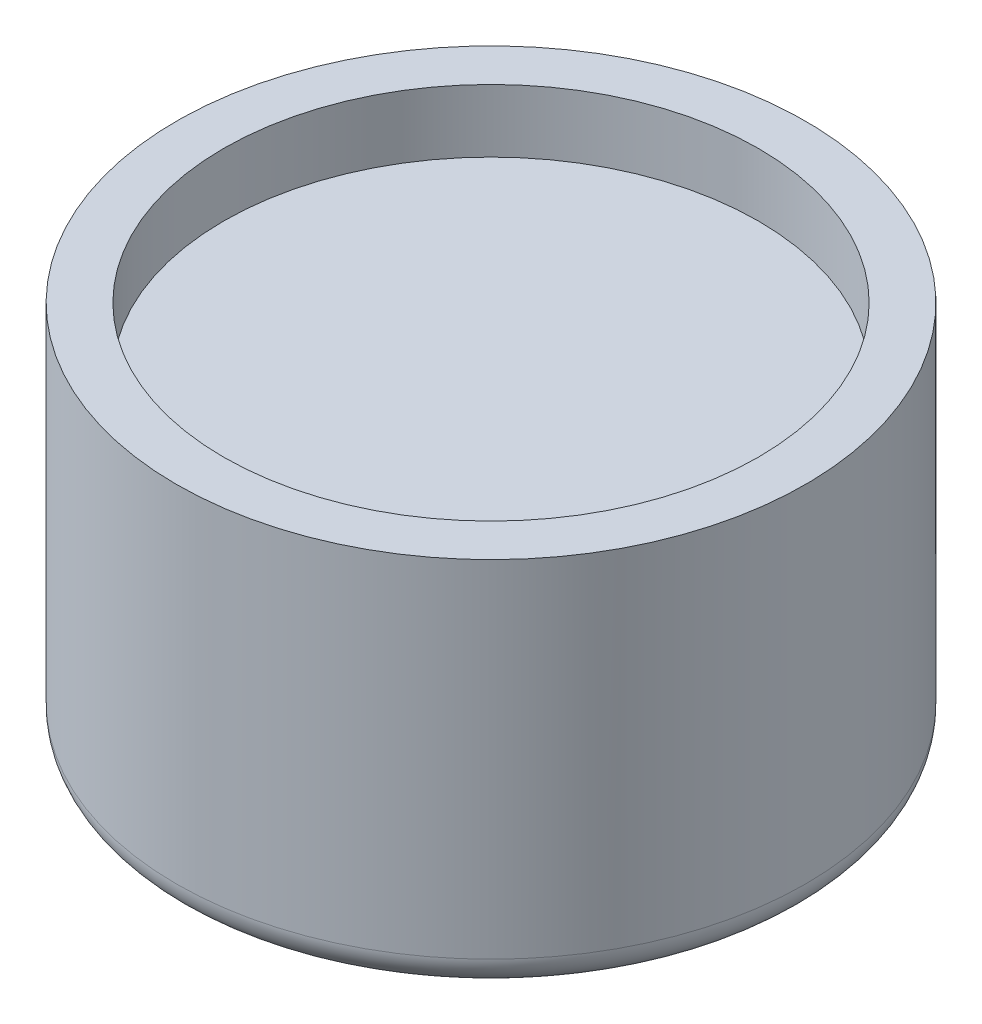
ISO-10303-21;
HEADER;
FILE_DESCRIPTION(('STEP AP214'),'2;1');
FILE_NAME('part.step','',(''),(''),'','','');
FILE_SCHEMA(('AUTOMOTIVE_DESIGN { 1 0 10303 214 1 1 1 1 }'));
ENDSEC;
DATA;
#1=APPLICATION_CONTEXT('core data for automotive mechanical design processes');
#2=APPLICATION_PROTOCOL_DEFINITION('international standard','automotive_design',2000,#1);
#3=PRODUCT_CONTEXT('',#1,'mechanical');
#4=PRODUCT('Part','Part','',(#3));
#5=PRODUCT_RELATED_PRODUCT_CATEGORY('part','',(#4));
#6=PRODUCT_DEFINITION_FORMATION('','',#4);
#7=PRODUCT_DEFINITION_CONTEXT('part definition',#1,'design');
#8=PRODUCT_DEFINITION('design','',#6,#7);
#9=PRODUCT_DEFINITION_SHAPE('','',#8);
#10=(LENGTH_UNIT() NAMED_UNIT(*) SI_UNIT(.MILLI.,.METRE.));
#11=(NAMED_UNIT(*) PLANE_ANGLE_UNIT() SI_UNIT($,.RADIAN.));
#12=(NAMED_UNIT(*) SI_UNIT($,.STERADIAN.) SOLID_ANGLE_UNIT());
#13=UNCERTAINTY_MEASURE_WITH_UNIT(LENGTH_MEASURE(1.E-05),#10,'distance_accuracy_value','');
#14=(GEOMETRIC_REPRESENTATION_CONTEXT(3) GLOBAL_UNCERTAINTY_ASSIGNED_CONTEXT((#13)) GLOBAL_UNIT_ASSIGNED_CONTEXT((#10,
#11,#12)) REPRESENTATION_CONTEXT('',''));
#15=CARTESIAN_POINT('',(0.,0.,0.));
#16=DIRECTION('',(0.,0.,1.));
#17=DIRECTION('',(1.,0.,0.));
#18=AXIS2_PLACEMENT_3D('',#15,#16,#17);
#19=CARTESIAN_POINT('',(0.,5.,0.));
#20=DIRECTION('',(0.,1.,0.));
#21=DIRECTION('',(0.,0.,1.));
#22=AXIS2_PLACEMENT_3D('',#19,#20,#21);
#23=PLANE('',#22);
#24=CARTESIAN_POINT('',(0.,5.,0.));
#25=DIRECTION('',(0.,1.,0.));
#26=DIRECTION('',(0.,0.,1.));
#27=AXIS2_PLACEMENT_3D('',#24,#25,#26);
#28=CIRCLE('',#27,4.25);
#29=CARTESIAN_POINT('',(0.,5.,4.25));
#30=VERTEX_POINT('',#29);
#31=EDGE_CURVE('E41',#30,#30,#28,.T.);
#32=ORIENTED_EDGE('',*,*,#31,.T.);
#33=EDGE_LOOP('',(#32));
#34=FACE_BOUND('',#33,.T.);
#35=ADVANCED_FACE('F16',(#34),#23,.T.);
#36=CARTESIAN_POINT('',(0.,6.,0.));
#37=DIRECTION('',(0.,1.,0.));
#38=DIRECTION('',(0.,0.,1.));
#39=AXIS2_PLACEMENT_3D('',#36,#37,#38);
#40=CYLINDRICAL_SURFACE('',#39,4.25);
#41=ORIENTED_EDGE('',*,*,#31,.F.);
#42=EDGE_LOOP('',(#41));
#43=FACE_BOUND('',#42,.T.);
#44=CARTESIAN_POINT('',(0.,6.,0.));
#45=DIRECTION('',(0.,1.,0.));
#46=DIRECTION('',(0.,0.,1.));
#47=AXIS2_PLACEMENT_3D('',#44,#45,#46);
#48=CIRCLE('',#47,4.25);
#49=CARTESIAN_POINT('',(0.,6.,4.25));
#50=VERTEX_POINT('',#49);
#51=EDGE_CURVE('E40',#50,#50,#48,.F.);
#52=ORIENTED_EDGE('',*,*,#51,.F.);
#53=EDGE_LOOP('',(#52));
#54=FACE_BOUND('',#53,.T.);
#55=ADVANCED_FACE('F73',(#43,#54),#40,.F.);
#56=CARTESIAN_POINT('',(0.,0.,0.));
#57=DIRECTION('',(0.,1.,0.));
#58=DIRECTION('',(0.,0.,1.));
#59=AXIS2_PLACEMENT_3D('',#56,#57,#58);
#60=PLANE('',#59);
#61=CARTESIAN_POINT('',(4.5,0.,0.));
#62=CARTESIAN_POINT('',(4.49999865411168,2.59689359989175E-12,-0.00499675006296749));
#63=CARTESIAN_POINT('',(4.49998954647222,4.87203615316466E-12,-0.00999345011623569));
#64=CARTESIAN_POINT('',(4.49995501930905,8.9327089056936E-12,-0.0200599822973414));
#65=CARTESIAN_POINT('',(4.49992936281391,1.07105794766739E-11,-0.0251298136019733));
#66=CARTESIAN_POINT('',(4.49943785046082,3.33516191594242E-11,-0.0979821605595964));
#67=CARTESIAN_POINT('',(4.49745256561761,1.82608353634555E-11,-0.165763677129862));
#68=CARTESIAN_POINT('',(4.490494512553,7.5309834208971E-12,-0.299725462395249));
#69=CARTESIAN_POINT('',(4.48558604828889,1.14858494829331E-11,-0.365909181856865));
#70=CARTESIAN_POINT('',(4.47298602629871,1.4093982737586E-11,-0.496563836197475));
#71=CARTESIAN_POINT('',(4.46535712980481,1.28603582760707E-11,-0.561040789973089));
#72=CARTESIAN_POINT('',(4.44751711752088,1.15263729310724E-11,-0.688178569808935));
#73=CARTESIAN_POINT('',(4.43736698888563,1.14014977418934E-11,-0.750847972107178));
#74=CARTESIAN_POINT('',(4.41395756768151,1.06370054190931E-11,-0.87824403248873));
#75=CARTESIAN_POINT('',(4.40058850786163,9.97663677320819E-12,-0.942950559134198));
#76=CARTESIAN_POINT('',(4.37138066635393,8.62503302038813E-12,-1.07011915694753));
#77=CARTESIAN_POINT('',(4.35561115898539,7.93496554984998E-12,-1.13259715403875));
#78=CARTESIAN_POINT('',(4.3218381136348,6.47119975005065E-12,-1.25524291034144));
#79=CARTESIAN_POINT('',(4.30390138685278,5.7000666631746E-12,-1.31542907167455));
#80=CARTESIAN_POINT('',(4.26602455695965,4.19405168575086E-12,-1.43344195397927));
#81=CARTESIAN_POINT('',(4.24614874063509,3.45874864721853E-12,-1.49128931516648));
#82=CARTESIAN_POINT('',(4.20461838350872,2.12303061026002E-12,-1.60459142234941));
#83=CARTESIAN_POINT('',(4.18302556303364,1.51953630170094E-12,-1.66006879784721));
#84=CARTESIAN_POINT('',(4.13827909763198,5.74205175569652E-13,-1.76861237421003));
#85=CARTESIAN_POINT('',(4.11518458048482,2.25639520609268E-13,-1.82170295649495));
#86=CARTESIAN_POINT('',(4.06764522901688,0.,-1.92546782045812));
#87=CARTESIAN_POINT('',(4.04325691899074,0.,-1.97616800465758));
#88=CARTESIAN_POINT('',(3.99333258263638,6.34351207089993E-13,-2.07515915717594));
#89=CARTESIAN_POINT('',(3.96785047983463,1.22918354127953E-12,-2.12347732699227));
#90=CARTESIAN_POINT('',(3.91593284418015,3.16581678824798E-12,-2.2177225689304));
#91=CARTESIAN_POINT('',(3.88954864934465,4.48473601440582E-12,-2.26367792803129));
#92=CARTESIAN_POINT('',(3.83601251462436,8.06861766353863E-12,-2.3532255324317));
#93=CARTESIAN_POINT('',(3.8089093532334,1.03031466455144E-11,-2.3968469463674));
#94=CARTESIAN_POINT('',(3.7541121119354,1.59362677338299E-11,-2.48176344850524));
#95=CARTESIAN_POINT('',(3.72646428848266,1.92955505796562E-11,-2.52308839100532));
#96=CARTESIAN_POINT('',(3.67074575006553,2.74158323091525E-11,-2.6034562827731));
#97=CARTESIAN_POINT('',(3.6427188099954,3.21271253225399E-11,-2.64252959163748));
#98=CARTESIAN_POINT('',(3.58640058249699,4.32053576779507E-11,-2.71844573299863));
#99=CARTESIAN_POINT('',(3.55815065761543,4.95105810152731E-11,-2.75531923773919));
#100=CARTESIAN_POINT('',(3.50153781425057,6.40607654844297E-11,-2.82689113145519));
#101=CARTESIAN_POINT('',(3.47321384426522,7.22296713374785E-11,-2.86162040309026));
#102=CARTESIAN_POINT('',(3.38985973887229,9.95277158890048E-11,-2.96076271343289));
#103=CARTESIAN_POINT('',(3.3335061701867,1.21939415561274E-10,-3.02407218811909));
#104=CARTESIAN_POINT('',(3.22180200666614,1.78626097712111E-10,-3.14264643117861));
#105=CARTESIAN_POINT('',(3.16670941724362,2.11852507423687E-10,-3.19815503152203));
#106=CARTESIAN_POINT('',(3.0584310495235,2.93322876760002E-10,-3.30170966693315));
#107=CARTESIAN_POINT('',(3.00547089179811,3.40079179106949E-10,-3.34999162754029));
#108=CARTESIAN_POINT('',(2.90224098845796,4.52010226715788E-10,-3.43968431911652));
#109=CARTESIAN_POINT('',(2.85216657757696,5.15115515559693E-10,-3.48132006629898));
#110=CARTESIAN_POINT('',(2.75537486348196,6.64096521296629E-10,-3.55831031051543));
#111=CARTESIAN_POINT('',(2.70882521781141,7.47050224096827E-10,-3.59387576463521));
#112=CARTESIAN_POINT('',(2.61964384553695,9.39078846639522E-10,-3.65929633348751));
#113=CARTESIAN_POINT('',(2.57715464359881,1.04420542408859E-09,-3.68934576688818));
#114=CARTESIAN_POINT('',(2.49656375555173,1.28947371942859E-09,-3.74427071246415));
#115=CARTESIAN_POINT('',(2.4585814422383,1.4235575400647E-09,-3.76932196718613));
#116=CARTESIAN_POINT('',(2.36005085614684,1.8359674869961E-09,-3.83218480886824));
#117=CARTESIAN_POINT('',(2.29895654801143,2.15295766165364E-09,-3.86914884219264));
#118=CARTESIAN_POINT('',(2.21967659550874,2.85451656375528E-09,-3.91457749645505));
#119=CARTESIAN_POINT('',(2.20225970589944,3.02619751430857E-09,-3.92440409178397));
#120=CARTESIAN_POINT('',(2.13924235196901,3.79410537307291E-09,-3.95940797631627));
#121=CARTESIAN_POINT('',(2.09326547778119,4.6295111582452E-09,-3.9839143138786));
#122=CARTESIAN_POINT('',(2.00049368312736,7.72900346212359E-09,-4.0313190485536));
#123=CARTESIAN_POINT('',(1.95369876036296,9.99309399549682E-09,-4.05421744114767));
#124=CARTESIAN_POINT('',(1.83110573556198,1.82325637024631E-08,-4.11159609440829));
#125=CARTESIAN_POINT('',(1.75470875480601,2.56180532676822E-08,-4.14480732556845));
#126=CARTESIAN_POINT('',(1.60019681162996,5.63609027570836E-08,-4.20695280703466));
#127=CARTESIAN_POINT('',(1.52208181856918,7.97185477682107E-08,-4.23588698098832));
#128=CARTESIAN_POINT('',(1.36158927598217,1.3517866802838E-07,-4.2903227767341));
#129=CARTESIAN_POINT('',(1.27915851590899,1.67560271350191E-07,-4.31566752860503));
#130=CARTESIAN_POINT('',(1.11297997369441,3.2229547544817E-07,-4.36162991289569));
#131=CARTESIAN_POINT('',(1.02923214452573,4.44652296050821E-07,-4.38224737611143));
#132=CARTESIAN_POINT('',(0.893210518311134,5.22967091260424E-07,-4.4115198127157));
#133=CARTESIAN_POINT('',(0.84126377211779,5.2491986657839E-07,-4.42172063360344));
#134=CARTESIAN_POINT('',(0.709349609812779,4.57737121334612E-07,-4.44516222716193));
#135=CARTESIAN_POINT('',(0.629152038692941,3.50298085661709E-07,-4.45714044541284));
#136=CARTESIAN_POINT('',(0.510919176837907,2.21070283018866E-07,-4.47153955966513));
#137=CARTESIAN_POINT('',(0.473080995279817,1.84076799194586E-07,-4.47566000959577));
#138=CARTESIAN_POINT('',(0.393292162141107,1.12163475969662E-07,-4.48331694925242));
#139=CARTESIAN_POINT('',(0.351330942319515,7.78796184002097E-08,-4.48674516587457));
#140=CARTESIAN_POINT('',(0.260918029761658,2.79479882455748E-08,-4.49286937058273));
#141=CARTESIAN_POINT('',(0.212453383455709,1.59440622452671E-08,-4.49537368951699));
#142=CARTESIAN_POINT('',(0.113572976139317,4.08862389302433E-09,-4.4989196897745));
#143=CARTESIAN_POINT('',(0.0631550150269918,4.73058879759908E-09,-4.49990035762631));
#144=CARTESIAN_POINT('',(-0.0447670899670695,2.94294463269521E-09,-4.50020866078059));
#145=CARTESIAN_POINT('',(-0.102271935772468,6.92706013065561E-11,-4.49928478348046));
#146=CARTESIAN_POINT('',(-0.219496883996692,3.42489690237561E-08,-4.49522330394998));
#147=CARTESIAN_POINT('',(-0.279214155120876,7.28944335360841E-08,-4.49199914187946));
#148=CARTESIAN_POINT('',(-0.346155855091588,9.98769209125065E-08,-4.4869896655943));
#149=CARTESIAN_POINT('',(-0.353476615030143,1.02607886031263E-07,-4.48642305349178));
#150=CARTESIAN_POINT('',(-0.388123657285773,1.1243687937026E-07,-4.48365139371331));
#151=CARTESIAN_POINT('',(-0.415430778810368,1.11064661437501E-07,-4.48120166667584));
#152=CARTESIAN_POINT('',(-0.488979909004488,1.08351333480203E-07,-4.47392701502406));
#153=CARTESIAN_POINT('',(-0.535175923104512,1.07696259921799E-07,-4.46863545923035));
#154=CARTESIAN_POINT('',(-0.646299961987057,1.02937448571343E-07,-4.45415342260339));
#155=CARTESIAN_POINT('',(-0.711137354607036,9.75290852324083E-08,-4.44425401302293));
#156=CARTESIAN_POINT('',(-0.815064321632313,8.90530821068662E-08,-4.42605380042151));
#157=CARTESIAN_POINT('',(-0.854312207985323,8.58968041216587E-08,-4.41864055642944));
#158=CARTESIAN_POINT('',(-0.937271538306661,7.90212902806841E-08,-4.40182362269227));
#159=CARTESIAN_POINT('',(-0.980956384771906,7.52798348455399E-08,-4.39228795895876));
#160=CARTESIAN_POINT('',(-1.07266578913683,6.74819955062817E-08,-4.37083233125505));
#161=CARTESIAN_POINT('',(-1.12065623479983,6.34345865761933E-08,-4.35876653811374));
#162=CARTESIAN_POINT('',(-1.22081837636423,5.51473111858201E-08,-4.33181949023177));
#163=CARTESIAN_POINT('',(-1.27294728494928,5.09264910763505E-08,-4.31677896287793));
#164=CARTESIAN_POINT('',(-1.38118407864704,4.2492976644423E-08,-4.28341813570604));
#165=CARTESIAN_POINT('',(-1.4372389408625,3.83136091774277E-08,-4.26492575248122));
#166=CARTESIAN_POINT('',(-1.55307747625644,3.01766155843957E-08,-4.22416680911618));
#167=CARTESIAN_POINT('',(-1.61279650562832,2.62641866466582E-08,-4.20171603005985));
#168=CARTESIAN_POINT('',(-1.71526845681852,2.01279369466837E-08,-4.16068565375369));
#169=CARTESIAN_POINT('',(-1.75825752831525,1.77331640912321E-08,-4.14269273435366));
#170=CARTESIAN_POINT('',(-1.84572036432615,1.32601894832249E-08,-4.10447829287175));
#171=CARTESIAN_POINT('',(-1.89016548571414,1.12028782059638E-08,-4.08419109284364));
#172=CARTESIAN_POINT('',(-1.98040422494043,7.50107029250143E-09,-4.04121207540746));
#173=CARTESIAN_POINT('',(-2.02616556632368,5.87997376428474E-09,-4.01845252223938));
#174=CARTESIAN_POINT('',(-2.11888632640923,3.14578599535284E-09,-3.97035015965651));
#175=CARTESIAN_POINT('',(-2.16580968937655,2.05822614735925E-09,-3.94493771323524));
#176=CARTESIAN_POINT('',(-2.23826793661094,8.8344503592233E-10,-3.90401348192259));
#177=CARTESIAN_POINT('',(-2.26412452022149,5.66615865899054E-10,-3.88906830342179));
#178=CARTESIAN_POINT('',(-2.31543985038303,1.37901598385976E-10,-3.85872272737265));
#179=CARTESIAN_POINT('',(-2.34089971722689,2.52603127115696E-11,-3.84332422497109));
#180=CARTESIAN_POINT('',(-2.40645863207055,-3.01989914719666E-11,-3.80277998809949));
#181=CARTESIAN_POINT('',(-2.44632078683041,1.66613590977135E-10,-3.77724985667688));
#182=CARTESIAN_POINT('',(-2.52498351307025,9.53902732878185E-10,-3.72510187643389));
#183=CARTESIAN_POINT('',(-2.56378900864303,1.54201725550955E-09,-3.69849144825557));
#184=CARTESIAN_POINT('',(-2.64031583590176,3.04025531138856E-09,-3.64423077766955));
#185=CARTESIAN_POINT('',(-2.67804228660985,3.9484197397186E-09,-3.61658775641122));
#186=CARTESIAN_POINT('',(-2.75238966817957,6.01997130422112E-09,-3.56031041244632));
#187=CARTESIAN_POINT('',(-2.78901590909801,7.18178005814181E-09,-3.53168310411577));
#188=CARTESIAN_POINT('',(-2.86114381242737,9.69798264247872E-09,-3.47348555605035));
#189=CARTESIAN_POINT('',(-2.89665096540876,1.10511604536398E-08,-3.44392212104288));
#190=CARTESIAN_POINT('',(-2.9665235901693,1.38918049680843E-08,-3.3839006602086));
#191=CARTESIAN_POINT('',(-3.00089472434781,1.53783980289682E-08,-3.35344922582049));
#192=CARTESIAN_POINT('',(-3.06848024027602,1.8431864227492E-08,-3.29169990541098));
#193=CARTESIAN_POINT('',(-3.10170044689178,1.99981859588746E-08,-3.2604083948696));
#194=CARTESIAN_POINT('',(-3.16697086628912,2.31614155034655E-08,-3.19702698690483));
#195=CARTESIAN_POINT('',(-3.19902705806199,2.47580733406543E-08,-3.16494324547877));
#196=CARTESIAN_POINT('',(-3.26195851119518,2.79365437991445E-08,-3.10002460708549));
#197=CARTESIAN_POINT('',(-3.29283989415986,2.95183868794281E-08,-3.06719564775748));
#198=CARTESIAN_POINT('',(-3.35341115214892,3.26262414151268E-08,-3.00083544859059));
#199=CARTESIAN_POINT('',(-3.38310729181109,3.41525411024271E-08,-2.96730991362886));
#200=CARTESIAN_POINT('',(-3.4701205773099,3.8577486919585E-08,-2.8660707498353));
#201=CARTESIAN_POINT('',(-3.52596084299639,4.13538352334384E-08,-2.79707678464828));
#202=CARTESIAN_POINT('',(-3.63277716599046,4.62855339343512E-08,-2.65681500027606));
#203=CARTESIAN_POINT('',(-3.68380618229313,4.84483535731855E-08,-2.58558740951594));
#204=CARTESIAN_POINT('',(-3.78099112992385,5.19782019791519E-08,-2.44121431615625));
#205=CARTESIAN_POINT('',(-3.82720149897263,5.33551504069439E-08,-2.36810547804084));
#206=CARTESIAN_POINT('',(-3.91475860300241,5.52070219635696E-08,-2.22032212644009));
#207=CARTESIAN_POINT('',(-3.9561610725322,5.56935137362828E-08,-2.14568062293429));
#208=CARTESIAN_POINT('',(-4.03413681421899,5.57277567157342E-08,-1.99517002264114));
#209=CARTESIAN_POINT('',(-4.07076683799535,5.52878691306394E-08,-1.91933032447582));
#210=CARTESIAN_POINT('',(-4.13925315750032,5.35019563454424E-08,-1.76674848524941));
#211=CARTESIAN_POINT('',(-4.17116698033033,5.21681854134207E-08,-1.69003216042974));
#212=CARTESIAN_POINT('',(-4.23029622028395,4.86965555901375E-08,-1.53600767108068));
#213=CARTESIAN_POINT('',(-4.2575697013798,4.65698940065424E-08,-1.45872179291051));
#214=CARTESIAN_POINT('',(-4.30751152028329,4.16839494576026E-08,-1.30385360230514));
#215=CARTESIAN_POINT('',(-4.33023823362103,3.89338049913649E-08,-1.22629011066383));
#216=CARTESIAN_POINT('',(-4.37119603971805,3.3042073032231E-08,-1.07114620679539));
#217=CARTESIAN_POINT('',(-4.38948560520694,2.99065033714248E-08,-0.993581227366811));
#218=CARTESIAN_POINT('',(-4.42169310947533,2.35540066275115E-08,-0.838697480894016));
#219=CARTESIAN_POINT('',(-4.43566941710033,2.03388661761525E-08,-0.761390847504664));
#220=CARTESIAN_POINT('',(-4.45938745429776,1.42094327489757E-08,-0.607270202396109));
#221=CARTESIAN_POINT('',(-4.46918725660169,1.12914746450038E-08,-0.530465124031946));
#222=CARTESIAN_POINT('',(-4.48469984442659,6.19929842642219E-09,-0.377577014533971));
#223=CARTESIAN_POINT('',(-4.49047024027305,4.01483870902E-09,-0.301499824810656));
#224=CARTESIAN_POINT('',(-4.4980838774236,9.35296215437472E-10,-0.150280002850962));
#225=CARTESIAN_POINT('',(-4.49998406401151,2.15806671612152E-11,-0.0751402337846427));
#226=CARTESIAN_POINT('',(-4.5,0.,0.));
#227=B_SPLINE_CURVE_WITH_KNOTS('',3,(#61,#62,#63,#64,#65,#66,#67,#68,#69,#70,#71,#72,#73,#74,
#75,#76,#77,#78,#79,#80,#81,#82,#83,#84,#85,#86,#87,#88,#89,#90,#91,#92,#93,#94,#95,#96,#97,#98,
#99,#100,#101,#102,#103,#104,#105,#106,#107,#108,#109,#110,#111,#112,#113,#114,#115,#116,#117,
#118,#119,#120,#121,#122,#123,#124,#125,#126,#127,#128,#129,#130,#131,#132,#133,#134,#135,#136,
#137,#138,#139,#140,#141,#142,#143,#144,#145,#146,#147,#148,#149,#150,#151,#152,#153,#154,#155,
#156,#157,#158,#159,#160,#161,#162,#163,#164,#165,#166,#167,#168,#169,#170,#171,#172,#173,#174,
#175,#176,#177,#178,#179,#180,#181,#182,#183,#184,#185,#186,#187,#188,#189,#190,#191,#192,#193,
#194,#195,#196,#197,#198,#199,#200,#201,#202,#203,#204,#205,#206,#207,#208,#209,#210,#211,#212,
#213,#214,#215,#216,#217,#218,#219,#220,#221,#222,#223,#224,#225,#226),.UNSPECIFIED.,.F.,.F.,(4,
2,2,2,2,2,2,2,2,2,2,2,2,2,2,2,2,2,2,2,2,2,2,2,2,2,2,2,2,2,2,2,2,2,2,2,2,2,2,2,2,2,2,2,2,2,2,2,2,
2,2,2,2,2,2,2,2,2,2,2,2,2,2,2,2,2,2,2,2,2,2,2,2,2,2,2,2,2,2,2,2,2,4),(0.,0.0149901476661609,
0.0301998608571977,0.233550581810033,0.432585167125211,0.62730357465238,0.817705762996362,
1.01586047869796,1.20911343958503,1.39746459153994,1.58091388159293,1.75946125792206,
1.93310666985333,2.10185006786061,2.26569140356561,2.42463062973804,2.57866770029544,
2.72780257030336,2.87203519597524,3.01136553467249,3.14579354490447,3.39991709707612,
3.63443628909124,3.84934999519121,4.04465717780114,4.22035688753495,4.37644826319996,
4.51293053180167,4.72705008888644,4.78704299320086,4.94330694468793,5.09957133528555,
5.3493453674624,5.59912385797141,5.85770338569847,6.11629216732629,6.27508177028886,
6.5181995553433,6.63237634540429,6.75866182382618,6.90422549646694,7.05548033243938,
7.22797885745074,7.4073361378346,7.42936411482671,7.51160928082153,7.65108271970444,
7.84777816676847,7.96759187484128,8.10171168832107,8.25013703115234,8.412867255836,
8.58990164343447,8.78123940357666,8.92102662129697,9.06756896709531,9.22086621807215,
9.38091813965098,9.47050809218592,9.5597655746598,9.70175112620632,9.84288728572676,
9.98317410699017,10.1226116429458,10.261199945723,10.3989390666309,10.5358290561593,
10.6718699639776,10.8070618389355,10.9414047290628,11.2075146691656,11.4702303250371,
11.7295520233217,11.9854800779125,12.2380147899512,12.4871564478282,12.7329053271823,
12.9752616909014,13.2142257891219,13.4497978592291,13.6819781258575,13.9107668008906,
14.1361640834615),.UNSPECIFIED.);
#228=CARTESIAN_POINT('',(4.5,0.,0.));
#229=VERTEX_POINT('',#228);
#230=CARTESIAN_POINT('',(-4.5,0.,0.));
#231=VERTEX_POINT('',#230);
#232=EDGE_CURVE('E33',#229,#231,#227,.T.);
#233=ORIENTED_EDGE('',*,*,#232,.F.);
#234=CARTESIAN_POINT('',(0.,0.,0.));
#235=DIRECTION('',(0.,1.,0.));
#236=DIRECTION('',(-1.,0.,0.));
#237=AXIS2_PLACEMENT_3D('',#234,#235,#236);
#238=CIRCLE('',#237,4.5);
#239=EDGE_CURVE('E38',#231,#229,#238,.T.);
#240=ORIENTED_EDGE('',*,*,#239,.F.);
#241=EDGE_LOOP('',(#233,#240));
#242=FACE_BOUND('',#241,.T.);
#243=ADVANCED_FACE('F37',(#242),#60,.F.);
#244=CARTESIAN_POINT('',(0.,6.,0.));
#245=DIRECTION('',(0.,1.,0.));
#246=DIRECTION('',(0.,0.,1.));
#247=AXIS2_PLACEMENT_3D('',#244,#245,#246);
#248=PLANE('',#247);
#249=ORIENTED_EDGE('',*,*,#51,.T.);
#250=EDGE_LOOP('',(#249));
#251=FACE_BOUND('',#250,.T.);
#252=CARTESIAN_POINT('',(0.,6.,0.));
#253=DIRECTION('',(0.,1.,0.));
#254=DIRECTION('',(0.,0.,1.));
#255=AXIS2_PLACEMENT_3D('',#252,#253,#254);
#256=CIRCLE('',#255,5.);
#257=CARTESIAN_POINT('',(0.,6.,5.));
#258=VERTEX_POINT('',#257);
#259=EDGE_CURVE('E26',#258,#258,#256,.F.);
#260=ORIENTED_EDGE('',*,*,#259,.F.);
#261=EDGE_LOOP('',(#260));
#262=FACE_BOUND('',#261,.T.);
#263=ADVANCED_FACE('F65',(#251,#262),#248,.T.);
#264=CARTESIAN_POINT('',(0.,0.5,0.));
#265=DIRECTION('',(0.,1.,0.));
#266=DIRECTION('',(0.999977480743138,0.,-0.00671103617982226));
#267=AXIS2_PLACEMENT_3D('',#264,#265,#266);
#268=TOROIDAL_SURFACE('',#267,4.5,0.5);
#269=CARTESIAN_POINT('',(0.,0.5,0.));
#270=DIRECTION('',(0.,1.,0.));
#271=DIRECTION('',(0.,0.,1.));
#272=AXIS2_PLACEMENT_3D('',#269,#270,#271);
#273=CIRCLE('',#272,5.);
#274=CARTESIAN_POINT('',(0.,0.5,5.));
#275=VERTEX_POINT('',#274);
#276=EDGE_CURVE('E11',#275,#275,#273,.T.);
#277=ORIENTED_EDGE('',*,*,#276,.F.);
#278=EDGE_LOOP('',(#277));
#279=FACE_BOUND('',#278,.T.);
#280=ORIENTED_EDGE('',*,*,#232,.T.);
#281=ORIENTED_EDGE('',*,*,#239,.T.);
#282=EDGE_LOOP('',(#280,#281));
#283=FACE_BOUND('',#282,.T.);
#284=ADVANCED_FACE('F44',(#279,#283),#268,.T.);
#285=CARTESIAN_POINT('',(0.,0.,0.));
#286=DIRECTION('',(0.,1.,0.));
#287=DIRECTION('',(0.,0.,1.));
#288=AXIS2_PLACEMENT_3D('',#285,#286,#287);
#289=CYLINDRICAL_SURFACE('',#288,5.);
#290=ORIENTED_EDGE('',*,*,#259,.T.);
#291=EDGE_LOOP('',(#290));
#292=FACE_BOUND('',#291,.T.);
#293=ORIENTED_EDGE('',*,*,#276,.T.);
#294=EDGE_LOOP('',(#293));
#295=FACE_BOUND('',#294,.T.);
#296=ADVANCED_FACE('F64',(#292,#295),#289,.T.);
#297=CLOSED_SHELL('',(#35,#55,#243,#263,#284,#296));
#298=MANIFOLD_SOLID_BREP('B1',#297);
#299=ADVANCED_BREP_SHAPE_REPRESENTATION('',(#18,#298),#14);
#300=SHAPE_DEFINITION_REPRESENTATION(#9,#299);
ENDSEC;
END-ISO-10303-21;
